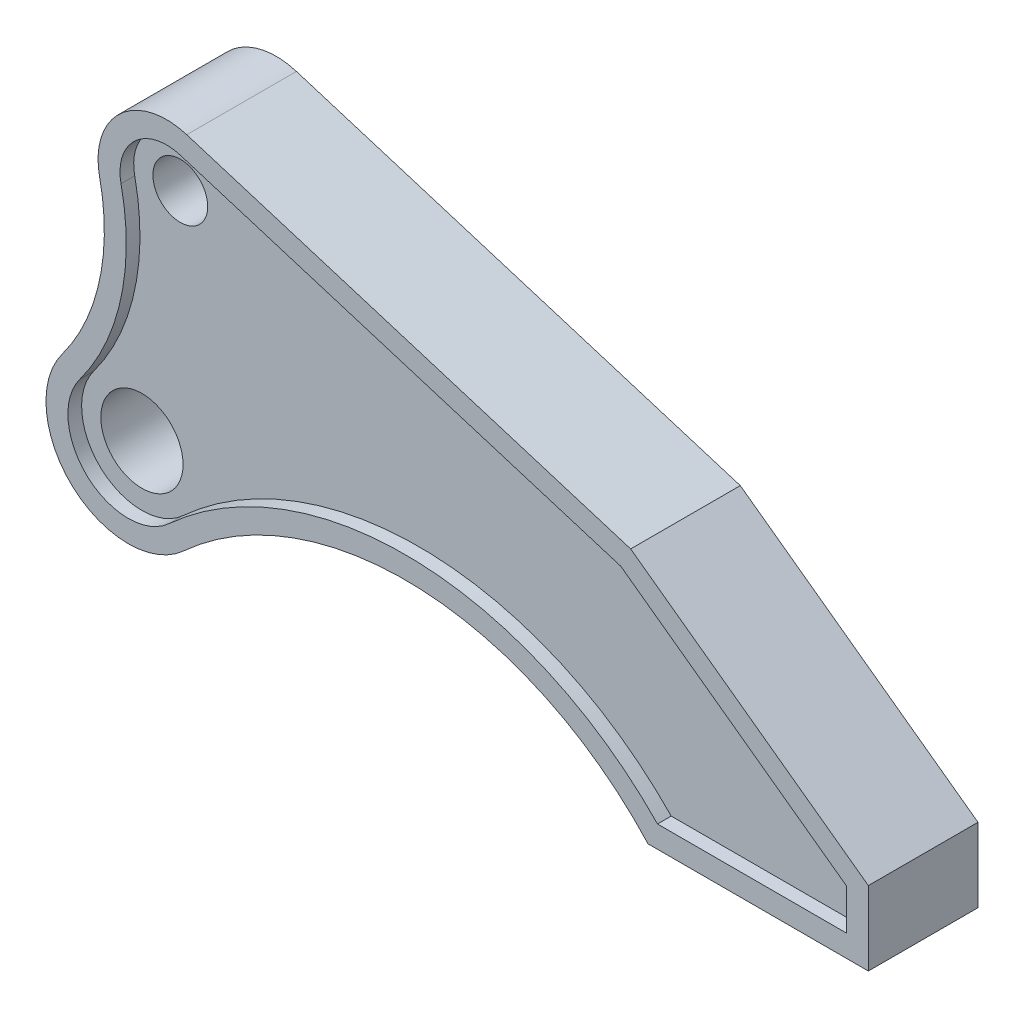
ISO-10303-21;
HEADER;
FILE_DESCRIPTION(('STEP AP214'),'2;1');
FILE_NAME('part.step','',(''),(''),'','','');
FILE_SCHEMA(('AUTOMOTIVE_DESIGN { 1 0 10303 214 1 1 1 1 }'));
ENDSEC;
DATA;
#1=APPLICATION_CONTEXT('core data for automotive mechanical design processes');
#2=APPLICATION_PROTOCOL_DEFINITION('international standard','automotive_design',2000,#1);
#3=PRODUCT_CONTEXT('',#1,'mechanical');
#4=PRODUCT('Part','Part','',(#3));
#5=PRODUCT_RELATED_PRODUCT_CATEGORY('part','',(#4));
#6=PRODUCT_DEFINITION_FORMATION('','',#4);
#7=PRODUCT_DEFINITION_CONTEXT('part definition',#1,'design');
#8=PRODUCT_DEFINITION('design','',#6,#7);
#9=PRODUCT_DEFINITION_SHAPE('','',#8);
#10=(LENGTH_UNIT() NAMED_UNIT(*) SI_UNIT(.MILLI.,.METRE.));
#11=(NAMED_UNIT(*) PLANE_ANGLE_UNIT() SI_UNIT($,.RADIAN.));
#12=(NAMED_UNIT(*) SI_UNIT($,.STERADIAN.) SOLID_ANGLE_UNIT());
#13=UNCERTAINTY_MEASURE_WITH_UNIT(LENGTH_MEASURE(1.E-05),#10,'distance_accuracy_value','');
#14=(GEOMETRIC_REPRESENTATION_CONTEXT(3) GLOBAL_UNCERTAINTY_ASSIGNED_CONTEXT((#13)) GLOBAL_UNIT_ASSIGNED_CONTEXT((#10,
#11,#12)) REPRESENTATION_CONTEXT('',''));
#15=CARTESIAN_POINT('',(0.,0.,0.));
#16=DIRECTION('',(0.,0.,1.));
#17=DIRECTION('',(1.,0.,0.));
#18=AXIS2_PLACEMENT_3D('',#15,#16,#17);
#19=CARTESIAN_POINT('',(0.,0.,15.));
#20=DIRECTION('',(0.,0.,1.));
#21=DIRECTION('',(1.,0.,0.));
#22=AXIS2_PLACEMENT_3D('',#19,#20,#21);
#23=PLANE('',#22);
#24=CARTESIAN_POINT('',(14.,86.,15.));
#25=DIRECTION('',(0.,0.,1.));
#26=DIRECTION('',(1.,0.,0.));
#27=AXIS2_PLACEMENT_3D('',#24,#25,#26);
#28=CIRCLE('',#27,10.);
#29=CARTESIAN_POINT('',(24.,86.,15.));
#30=VERTEX_POINT('',#29);
#31=EDGE_CURVE('E386',#30,#30,#28,.T.);
#32=ORIENTED_EDGE('',*,*,#31,.F.);
#33=EDGE_LOOP('',(#32));
#34=FACE_BOUND('',#33,.T.);
#35=CARTESIAN_POINT('',(0.,0.,15.));
#36=DIRECTION('',(0.,0.,1.));
#37=DIRECTION('',(1.,0.,0.));
#38=AXIS2_PLACEMENT_3D('',#35,#36,#37);
#39=CIRCLE('',#38,15.);
#40=CARTESIAN_POINT('',(15.,0.,15.));
#41=VERTEX_POINT('',#40);
#42=EDGE_CURVE('E391',#41,#41,#39,.T.);
#43=ORIENTED_EDGE('',*,*,#42,.F.);
#44=EDGE_LOOP('',(#43));
#45=FACE_BOUND('',#44,.T.);
#46=CARTESIAN_POINT('',(0.,0.,15.));
#47=DIRECTION('',(0.,0.,1.));
#48=DIRECTION('',(1.,0.,0.));
#49=AXIS2_PLACEMENT_3D('',#46,#47,#48);
#50=CIRCLE('',#49,22.);
#51=CARTESIAN_POINT('',(14.8133333333334,-16.2654589715617,15.));
#52=VERTEX_POINT('',#51);
#53=CARTESIAN_POINT('',(-17.6625754821289,13.1161513920089,15.));
#54=VERTEX_POINT('',#53);
#55=EDGE_CURVE('E52',#52,#54,#50,.F.);
#56=ORIENTED_EDGE('',*,*,#55,.F.);
#57=CARTESIAN_POINT('',(101.,-110.900856624284,15.));
#58=DIRECTION('',(0.,0.,1.));
#59=DIRECTION('',(1.,0.,0.));
#60=AXIS2_PLACEMENT_3D('',#57,#58,#59);
#61=CIRCLE('',#60,128.);
#62=CARTESIAN_POINT('',(193.090377844097,-22.,15.));
#63=VERTEX_POINT('',#62);
#64=EDGE_CURVE('E56',#63,#52,#61,.T.);
#65=ORIENTED_EDGE('',*,*,#64,.F.);
#66=DIRECTION('',(-1.,0.,0.));
#67=VECTOR('',#66,1.);
#68=CARTESIAN_POINT('',(0.,-22.,15.));
#69=LINE('',#68,#67);
#70=CARTESIAN_POINT('',(262.,-22.,15.));
#71=VERTEX_POINT('',#70);
#72=EDGE_CURVE('E345',#71,#63,#69,.T.);
#73=ORIENTED_EDGE('',*,*,#72,.F.);
#74=DIRECTION('',(0.,-1.,0.));
#75=VECTOR('',#74,1.);
#76=CARTESIAN_POINT('',(262.,0.,15.));
#77=LINE('',#76,#75);
#78=CARTESIAN_POINT('',(262.,-7.0762035959553,15.));
#79=VERTEX_POINT('',#78);
#80=EDGE_CURVE('E342',#79,#71,#77,.T.);
#81=ORIENTED_EDGE('',*,*,#80,.F.);
#82=DIRECTION('',(0.809016994374951,-0.587785252292468,0.));
#83=VECTOR('',#82,1.);
#84=CARTESIAN_POINT('',(87.1538389665981,119.956968253283,15.));
#85=LINE('',#84,#83);
#86=CARTESIAN_POINT('',(179.661480344658,52.7462326266555,15.));
#87=VERTEX_POINT('',#86);
#88=EDGE_CURVE('E339',#87,#79,#85,.T.);
#89=ORIENTED_EDGE('',*,*,#88,.F.);
#90=DIRECTION('',(0.955666007973527,-0.294452850561754,0.));
#91=VECTOR('',#90,1.);
#92=CARTESIAN_POINT('',(30.4198110964239,98.7294888752698,15.));
#93=LINE('',#92,#91);
#94=CARTESIAN_POINT('',(19.0056984595498,102.24632213555,15.));
#95=VERTEX_POINT('',#94);
#96=EDGE_CURVE('E336',#95,#87,#93,.T.);
#97=ORIENTED_EDGE('',*,*,#96,.F.);
#98=CARTESIAN_POINT('',(14.,86.,15.));
#99=DIRECTION('',(0.,0.,1.));
#100=DIRECTION('',(1.,0.,0.));
#101=AXIS2_PLACEMENT_3D('',#98,#99,#100);
#102=CIRCLE('',#101,17.);
#103=CARTESIAN_POINT('',(-2.6215748390065,82.4330335197389,15.));
#104=VERTEX_POINT('',#103);
#105=EDGE_CURVE('E333',#104,#95,#102,.F.);
#106=ORIENTED_EDGE('',*,*,#105,.F.);
#107=CARTESIAN_POINT('',(-86.7071887304512,64.3883795607711,15.));
#108=DIRECTION('',(0.,0.,1.));
#109=DIRECTION('',(1.,0.,0.));
#110=AXIS2_PLACEMENT_3D('',#107,#108,#109);
#111=CIRCLE('',#110,86.);
#112=EDGE_CURVE('E308',#54,#104,#111,.T.);
#113=ORIENTED_EDGE('',*,*,#112,.F.);
#114=EDGE_LOOP('',(#56,#65,#73,#81,#89,#97,#106,#113));
#115=FACE_BOUND('',#114,.T.);
#116=ADVANCED_FACE('F35',(#34,#45,#115),#23,.T.);
#117=CARTESIAN_POINT('',(0.,0.,20.));
#118=DIRECTION('',(0.,0.,1.));
#119=DIRECTION('',(1.,0.,0.));
#120=AXIS2_PLACEMENT_3D('',#117,#118,#119);
#121=PLANE('',#120);
#122=CARTESIAN_POINT('',(0.,0.,20.));
#123=DIRECTION('',(0.,0.,1.));
#124=DIRECTION('',(1.,0.,0.));
#125=AXIS2_PLACEMENT_3D('',#122,#123,#124);
#126=CIRCLE('',#125,30.);
#127=CARTESIAN_POINT('',(-24.0853302029031,17.8856609891031,20.));
#128=VERTEX_POINT('',#127);
#129=CARTESIAN_POINT('',(20.2,-22.1801713248568,20.));
#130=VERTEX_POINT('',#129);
#131=EDGE_CURVE('E283',#128,#130,#126,.T.);
#132=ORIENTED_EDGE('',*,*,#131,.T.);
#133=CARTESIAN_POINT('',(101.,-110.900856624284,20.));
#134=DIRECTION('',(0.,0.,-1.));
#135=DIRECTION('',(1.,0.,0.));
#136=AXIS2_PLACEMENT_3D('',#133,#134,#135);
#137=CIRCLE('',#136,120.);
#138=CARTESIAN_POINT('',(189.628727833909,-30.,20.));
#139=VERTEX_POINT('',#138);
#140=EDGE_CURVE('E286',#130,#139,#137,.T.);
#141=ORIENTED_EDGE('',*,*,#140,.T.);
#142=DIRECTION('',(1.,0.,0.));
#143=VECTOR('',#142,1.);
#144=CARTESIAN_POINT('',(189.628727833909,-30.,20.));
#145=LINE('',#144,#143);
#146=CARTESIAN_POINT('',(270.,-30.,20.));
#147=VERTEX_POINT('',#146);
#148=EDGE_CURVE('E290',#139,#147,#145,.T.);
#149=ORIENTED_EDGE('',*,*,#148,.T.);
#150=DIRECTION('',(0.,1.,0.));
#151=VECTOR('',#150,1.);
#152=CARTESIAN_POINT('',(270.,-30.,20.));
#153=LINE('',#152,#151);
#154=CARTESIAN_POINT('',(270.,-2.99999999999995,20.));
#155=VERTEX_POINT('',#154);
#156=EDGE_CURVE('E293',#147,#155,#153,.T.);
#157=ORIENTED_EDGE('',*,*,#156,.T.);
#158=DIRECTION('',(-0.809016994374951,0.587785252292468,0.));
#159=VECTOR('',#158,1.);
#160=CARTESIAN_POINT('',(270.,-2.99999999999995,20.));
#161=LINE('',#160,#159);
#162=CARTESIAN_POINT('',(183.287939010315,60.,20.));
#163=VERTEX_POINT('',#162);
#164=EDGE_CURVE('E296',#155,#163,#161,.T.);
#165=ORIENTED_EDGE('',*,*,#164,.T.);
#166=DIRECTION('',(-0.955666007973527,0.294452850561754,0.));
#167=VECTOR('',#166,1.);
#168=CARTESIAN_POINT('',(183.287939010315,60.,20.));
#169=LINE('',#168,#167);
#170=CARTESIAN_POINT('',(21.3613212640438,109.891650199338,20.));
#171=VERTEX_POINT('',#170);
#172=EDGE_CURVE('E299',#163,#171,#169,.T.);
#173=ORIENTED_EDGE('',*,*,#172,.T.);
#174=CARTESIAN_POINT('',(14.,86.,20.));
#175=DIRECTION('',(0.,0.,1.));
#176=DIRECTION('',(1.,0.,0.));
#177=AXIS2_PLACEMENT_3D('',#174,#175,#176);
#178=CIRCLE('',#177,25.);
#179=CARTESIAN_POINT('',(-10.4434924103037,80.7544610584396,20.));
#180=VERTEX_POINT('',#179);
#181=EDGE_CURVE('E302',#171,#180,#178,.T.);
#182=ORIENTED_EDGE('',*,*,#181,.T.);
#183=CARTESIAN_POINT('',(-86.7071887304512,64.3883795607711,20.));
#184=DIRECTION('',(0.,0.,-1.));
#185=DIRECTION('',(1.,0.,0.));
#186=AXIS2_PLACEMENT_3D('',#183,#184,#185);
#187=CIRCLE('',#186,78.);
#188=EDGE_CURVE('E305',#180,#128,#187,.T.);
#189=ORIENTED_EDGE('',*,*,#188,.T.);
#190=EDGE_LOOP('',(#132,#141,#149,#157,#165,#173,#182,#189));
#191=FACE_BOUND('',#190,.T.);
#192=CARTESIAN_POINT('',(101.,-110.900856624284,20.));
#193=DIRECTION('',(0.,0.,-1.));
#194=DIRECTION('',(1.,0.,0.));
#195=AXIS2_PLACEMENT_3D('',#192,#193,#194);
#196=CIRCLE('',#195,128.);
#197=CARTESIAN_POINT('',(14.8133333333334,-16.2654589715617,20.));
#198=VERTEX_POINT('',#197);
#199=CARTESIAN_POINT('',(193.090377844097,-22.,20.));
#200=VERTEX_POINT('',#199);
#201=EDGE_CURVE('E206',#198,#200,#196,.T.);
#202=ORIENTED_EDGE('',*,*,#201,.F.);
#203=CARTESIAN_POINT('',(0.,0.,20.));
#204=DIRECTION('',(0.,0.,1.));
#205=DIRECTION('',(1.,0.,0.));
#206=AXIS2_PLACEMENT_3D('',#203,#204,#205);
#207=CIRCLE('',#206,22.);
#208=CARTESIAN_POINT('',(-17.6625754821289,13.1161513920089,20.));
#209=VERTEX_POINT('',#208);
#210=EDGE_CURVE('E197',#209,#198,#207,.T.);
#211=ORIENTED_EDGE('',*,*,#210,.F.);
#212=CARTESIAN_POINT('',(-86.7071887304512,64.3883795607711,20.));
#213=DIRECTION('',(0.,0.,-1.));
#214=DIRECTION('',(1.,0.,0.));
#215=AXIS2_PLACEMENT_3D('',#212,#213,#214);
#216=CIRCLE('',#215,86.);
#217=CARTESIAN_POINT('',(-2.6215748390065,82.4330335197389,20.));
#218=VERTEX_POINT('',#217);
#219=EDGE_CURVE('E233',#218,#209,#216,.T.);
#220=ORIENTED_EDGE('',*,*,#219,.F.);
#221=CARTESIAN_POINT('',(14.,86.,20.));
#222=DIRECTION('',(0.,0.,1.));
#223=DIRECTION('',(1.,0.,0.));
#224=AXIS2_PLACEMENT_3D('',#221,#222,#223);
#225=CIRCLE('',#224,17.);
#226=CARTESIAN_POINT('',(19.0056984595498,102.24632213555,20.));
#227=VERTEX_POINT('',#226);
#228=EDGE_CURVE('E230',#227,#218,#225,.T.);
#229=ORIENTED_EDGE('',*,*,#228,.F.);
#230=DIRECTION('',(-0.955666007973527,0.294452850561754,0.));
#231=VECTOR('',#230,1.);
#232=CARTESIAN_POINT('',(179.661480344658,52.7462326266555,20.));
#233=LINE('',#232,#231);
#234=CARTESIAN_POINT('',(179.661480344658,52.7462326266555,20.));
#235=VERTEX_POINT('',#234);
#236=EDGE_CURVE('E228',#235,#227,#233,.T.);
#237=ORIENTED_EDGE('',*,*,#236,.F.);
#238=DIRECTION('',(-0.809016994374951,0.587785252292468,0.));
#239=VECTOR('',#238,1.);
#240=CARTESIAN_POINT('',(262.,-7.07620359595538,20.));
#241=LINE('',#240,#239);
#242=CARTESIAN_POINT('',(262.,-7.07620359595538,20.));
#243=VERTEX_POINT('',#242);
#244=EDGE_CURVE('E226',#243,#235,#241,.T.);
#245=ORIENTED_EDGE('',*,*,#244,.F.);
#246=DIRECTION('',(0.,1.,0.));
#247=VECTOR('',#246,1.);
#248=CARTESIAN_POINT('',(262.,-22.,20.));
#249=LINE('',#248,#247);
#250=CARTESIAN_POINT('',(262.,-22.,20.));
#251=VERTEX_POINT('',#250);
#252=EDGE_CURVE('E221',#251,#243,#249,.T.);
#253=ORIENTED_EDGE('',*,*,#252,.F.);
#254=DIRECTION('',(1.,0.,0.));
#255=VECTOR('',#254,1.);
#256=CARTESIAN_POINT('',(193.090377844097,-22.,20.));
#257=LINE('',#256,#255);
#258=EDGE_CURVE('E219',#200,#251,#257,.T.);
#259=ORIENTED_EDGE('',*,*,#258,.F.);
#260=EDGE_LOOP('',(#202,#211,#220,#229,#237,#245,#253,#259));
#261=FACE_BOUND('',#260,.T.);
#262=ADVANCED_FACE('F217',(#191,#261),#121,.T.);
#263=CARTESIAN_POINT('',(0.,0.,20.));
#264=DIRECTION('',(0.,0.,-1.));
#265=DIRECTION('',(-1.,0.,0.));
#266=AXIS2_PLACEMENT_3D('',#263,#264,#265);
#267=CYLINDRICAL_SURFACE('',#266,22.);
#268=DIRECTION('',(0.,0.,-1.));
#269=VECTOR('',#268,1.);
#270=CARTESIAN_POINT('',(14.8133333333334,-16.2654589715617,20.));
#271=LINE('',#270,#269);
#272=EDGE_CURVE('E200',#198,#52,#271,.T.);
#273=ORIENTED_EDGE('',*,*,#272,.T.);
#274=ORIENTED_EDGE('',*,*,#55,.T.);
#275=DIRECTION('',(0.,0.,-1.));
#276=VECTOR('',#275,1.);
#277=CARTESIAN_POINT('',(-17.6625754821289,13.1161513920089,20.));
#278=LINE('',#277,#276);
#279=EDGE_CURVE('E202',#209,#54,#278,.T.);
#280=ORIENTED_EDGE('',*,*,#279,.F.);
#281=ORIENTED_EDGE('',*,*,#210,.T.);
#282=EDGE_LOOP('',(#273,#274,#280,#281));
#283=FACE_BOUND('',#282,.T.);
#284=ADVANCED_FACE('F199',(#283),#267,.F.);
#285=CARTESIAN_POINT('',(101.,-110.900856624284,20.));
#286=DIRECTION('',(0.,0.,-1.));
#287=DIRECTION('',(-1.,0.,0.));
#288=AXIS2_PLACEMENT_3D('',#285,#286,#287);
#289=CYLINDRICAL_SURFACE('',#288,128.);
#290=DIRECTION('',(0.,0.,-1.));
#291=VECTOR('',#290,1.);
#292=CARTESIAN_POINT('',(193.090377844097,-22.,20.));
#293=LINE('',#292,#291);
#294=EDGE_CURVE('E281',#200,#63,#293,.T.);
#295=ORIENTED_EDGE('',*,*,#294,.T.);
#296=ORIENTED_EDGE('',*,*,#64,.T.);
#297=ORIENTED_EDGE('',*,*,#272,.F.);
#298=ORIENTED_EDGE('',*,*,#201,.T.);
#299=EDGE_LOOP('',(#295,#296,#297,#298));
#300=FACE_BOUND('',#299,.T.);
#301=ADVANCED_FACE('F211',(#300),#289,.T.);
#302=CARTESIAN_POINT('',(193.090377844097,-22.,20.));
#303=DIRECTION('',(0.,1.,0.));
#304=DIRECTION('',(-1.,0.,0.));
#305=AXIS2_PLACEMENT_3D('',#302,#303,#304);
#306=PLANE('',#305);
#307=DIRECTION('',(0.,0.,-1.));
#308=VECTOR('',#307,1.);
#309=CARTESIAN_POINT('',(262.,-22.,20.));
#310=LINE('',#309,#308);
#311=EDGE_CURVE('E277',#251,#71,#310,.T.);
#312=ORIENTED_EDGE('',*,*,#311,.T.);
#313=ORIENTED_EDGE('',*,*,#72,.T.);
#314=ORIENTED_EDGE('',*,*,#294,.F.);
#315=ORIENTED_EDGE('',*,*,#258,.T.);
#316=EDGE_LOOP('',(#312,#313,#314,#315));
#317=FACE_BOUND('',#316,.T.);
#318=ADVANCED_FACE('F527',(#317),#306,.T.);
#319=CARTESIAN_POINT('',(262.,-22.,20.));
#320=DIRECTION('',(-1.,0.,0.));
#321=DIRECTION('',(0.,0.,1.));
#322=AXIS2_PLACEMENT_3D('',#319,#320,#321);
#323=PLANE('',#322);
#324=DIRECTION('',(0.,0.,-1.));
#325=VECTOR('',#324,1.);
#326=CARTESIAN_POINT('',(262.,-7.07620359595538,20.));
#327=LINE('',#326,#325);
#328=EDGE_CURVE('E273',#243,#79,#327,.T.);
#329=ORIENTED_EDGE('',*,*,#328,.T.);
#330=ORIENTED_EDGE('',*,*,#80,.T.);
#331=ORIENTED_EDGE('',*,*,#311,.F.);
#332=ORIENTED_EDGE('',*,*,#252,.T.);
#333=EDGE_LOOP('',(#329,#330,#331,#332));
#334=FACE_BOUND('',#333,.T.);
#335=ADVANCED_FACE('F525',(#334),#323,.T.);
#336=CARTESIAN_POINT('',(262.,-7.07620359595538,20.));
#337=DIRECTION('',(-0.587785252292468,-0.809016994374951,0.));
#338=DIRECTION('',(0.809016994374951,-0.587785252292468,0.));
#339=AXIS2_PLACEMENT_3D('',#336,#337,#338);
#340=PLANE('',#339);
#341=DIRECTION('',(0.,0.,-1.));
#342=VECTOR('',#341,1.);
#343=CARTESIAN_POINT('',(179.661480344658,52.7462326266555,20.));
#344=LINE('',#343,#342);
#345=EDGE_CURVE('E269',#235,#87,#344,.T.);
#346=ORIENTED_EDGE('',*,*,#345,.T.);
#347=ORIENTED_EDGE('',*,*,#88,.T.);
#348=ORIENTED_EDGE('',*,*,#328,.F.);
#349=ORIENTED_EDGE('',*,*,#244,.T.);
#350=EDGE_LOOP('',(#346,#347,#348,#349));
#351=FACE_BOUND('',#350,.T.);
#352=ADVANCED_FACE('F521',(#351),#340,.T.);
#353=CARTESIAN_POINT('',(179.661480344658,52.7462326266555,20.));
#354=DIRECTION('',(-0.294452850561754,-0.955666007973527,0.));
#355=DIRECTION('',(0.955666007973527,-0.294452850561754,0.));
#356=AXIS2_PLACEMENT_3D('',#353,#354,#355);
#357=PLANE('',#356);
#358=DIRECTION('',(0.,0.,-1.));
#359=VECTOR('',#358,1.);
#360=CARTESIAN_POINT('',(19.0056984595498,102.24632213555,20.));
#361=LINE('',#360,#359);
#362=EDGE_CURVE('E265',#227,#95,#361,.T.);
#363=ORIENTED_EDGE('',*,*,#362,.T.);
#364=ORIENTED_EDGE('',*,*,#96,.T.);
#365=ORIENTED_EDGE('',*,*,#345,.F.);
#366=ORIENTED_EDGE('',*,*,#236,.T.);
#367=EDGE_LOOP('',(#363,#364,#365,#366));
#368=FACE_BOUND('',#367,.T.);
#369=ADVANCED_FACE('F512',(#368),#357,.T.);
#370=CARTESIAN_POINT('',(14.,86.,20.));
#371=DIRECTION('',(0.,0.,-1.));
#372=DIRECTION('',(-1.,0.,0.));
#373=AXIS2_PLACEMENT_3D('',#370,#371,#372);
#374=CYLINDRICAL_SURFACE('',#373,17.);
#375=DIRECTION('',(0.,0.,-1.));
#376=VECTOR('',#375,1.);
#377=CARTESIAN_POINT('',(-2.6215748390065,82.4330335197389,20.));
#378=LINE('',#377,#376);
#379=EDGE_CURVE('E261',#218,#104,#378,.T.);
#380=ORIENTED_EDGE('',*,*,#379,.T.);
#381=ORIENTED_EDGE('',*,*,#105,.T.);
#382=ORIENTED_EDGE('',*,*,#362,.F.);
#383=ORIENTED_EDGE('',*,*,#228,.T.);
#384=EDGE_LOOP('',(#380,#381,#382,#383));
#385=FACE_BOUND('',#384,.T.);
#386=ADVANCED_FACE('F504',(#385),#374,.F.);
#387=CARTESIAN_POINT('',(-86.7071887304512,64.3883795607711,20.));
#388=DIRECTION('',(0.,0.,-1.));
#389=DIRECTION('',(-1.,0.,0.));
#390=AXIS2_PLACEMENT_3D('',#387,#388,#389);
#391=CYLINDRICAL_SURFACE('',#390,86.);
#392=ORIENTED_EDGE('',*,*,#279,.T.);
#393=ORIENTED_EDGE('',*,*,#112,.T.);
#394=ORIENTED_EDGE('',*,*,#379,.F.);
#395=ORIENTED_EDGE('',*,*,#219,.T.);
#396=EDGE_LOOP('',(#392,#393,#394,#395));
#397=FACE_BOUND('',#396,.T.);
#398=ADVANCED_FACE('F499',(#397),#391,.T.);
#399=CARTESIAN_POINT('',(-86.7071887304512,64.3883795607711,15.));
#400=DIRECTION('',(0.,0.,-1.));
#401=DIRECTION('',(-1.,0.,0.));
#402=AXIS2_PLACEMENT_3D('',#399,#400,#401);
#403=CYLINDRICAL_SURFACE('',#402,78.);
#404=DIRECTION('',(0.,0.,-1.));
#405=VECTOR('',#404,1.);
#406=CARTESIAN_POINT('',(-10.4434924103037,80.7544610584396,15.));
#407=LINE('',#406,#405);
#408=CARTESIAN_POINT('',(-10.4434924103037,80.7544610584396,-20.));
#409=VERTEX_POINT('',#408);
#410=EDGE_CURVE('E349',#180,#409,#407,.T.);
#411=ORIENTED_EDGE('',*,*,#410,.T.);
#412=CARTESIAN_POINT('',(-86.7071887304512,64.3883795607711,-20.));
#413=DIRECTION('',(0.,0.,-1.));
#414=DIRECTION('',(1.,0.,0.));
#415=AXIS2_PLACEMENT_3D('',#412,#413,#414);
#416=CIRCLE('',#415,78.);
#417=CARTESIAN_POINT('',(-24.0853302029031,17.8856609891031,-20.));
#418=VERTEX_POINT('',#417);
#419=EDGE_CURVE('E287',#409,#418,#416,.T.);
#420=ORIENTED_EDGE('',*,*,#419,.T.);
#421=DIRECTION('',(0.,0.,-1.));
#422=VECTOR('',#421,1.);
#423=CARTESIAN_POINT('',(-24.0853302029031,17.8856609891031,15.));
#424=LINE('',#423,#422);
#425=EDGE_CURVE('E363',#128,#418,#424,.T.);
#426=ORIENTED_EDGE('',*,*,#425,.F.);
#427=ORIENTED_EDGE('',*,*,#188,.F.);
#428=EDGE_LOOP('',(#411,#420,#426,#427));
#429=FACE_BOUND('',#428,.T.);
#430=ADVANCED_FACE('F37',(#429),#403,.F.);
#431=CARTESIAN_POINT('',(14.,86.,15.));
#432=DIRECTION('',(0.,0.,-1.));
#433=DIRECTION('',(-1.,0.,0.));
#434=AXIS2_PLACEMENT_3D('',#431,#432,#433);
#435=CYLINDRICAL_SURFACE('',#434,25.);
#436=DIRECTION('',(0.,0.,-1.));
#437=VECTOR('',#436,1.);
#438=CARTESIAN_POINT('',(21.3613212640438,109.891650199338,15.));
#439=LINE('',#438,#437);
#440=CARTESIAN_POINT('',(21.3613212640438,109.891650199338,-20.));
#441=VERTEX_POINT('',#440);
#442=EDGE_CURVE('E351',#171,#441,#439,.T.);
#443=ORIENTED_EDGE('',*,*,#442,.T.);
#444=CARTESIAN_POINT('',(14.,86.,-20.));
#445=DIRECTION('',(0.,0.,1.));
#446=DIRECTION('',(1.,0.,0.));
#447=AXIS2_PLACEMENT_3D('',#444,#445,#446);
#448=CIRCLE('',#447,25.);
#449=EDGE_CURVE('E326',#441,#409,#448,.T.);
#450=ORIENTED_EDGE('',*,*,#449,.T.);
#451=ORIENTED_EDGE('',*,*,#410,.F.);
#452=ORIENTED_EDGE('',*,*,#181,.F.);
#453=EDGE_LOOP('',(#443,#450,#451,#452));
#454=FACE_BOUND('',#453,.T.);
#455=ADVANCED_FACE('F417',(#454),#435,.T.);
#456=CARTESIAN_POINT('',(32.7754339009179,106.374816939058,15.));
#457=DIRECTION('',(0.294452850561754,0.955666007973527,0.));
#458=DIRECTION('',(-0.955666007973527,0.294452850561754,0.));
#459=AXIS2_PLACEMENT_3D('',#456,#457,#458);
#460=PLANE('',#459);
#461=DIRECTION('',(0.,0.,-1.));
#462=VECTOR('',#461,1.);
#463=CARTESIAN_POINT('',(183.287939010315,60.,15.));
#464=LINE('',#463,#462);
#465=CARTESIAN_POINT('',(183.287939010315,60.,-20.));
#466=VERTEX_POINT('',#465);
#467=EDGE_CURVE('E353',#163,#466,#464,.T.);
#468=ORIENTED_EDGE('',*,*,#467,.T.);
#469=DIRECTION('',(-0.955666007973527,0.294452850561754,0.));
#470=VECTOR('',#469,1.);
#471=CARTESIAN_POINT('',(183.287939010315,60.,-20.));
#472=LINE('',#471,#470);
#473=EDGE_CURVE('E323',#466,#441,#472,.T.);
#474=ORIENTED_EDGE('',*,*,#473,.T.);
#475=ORIENTED_EDGE('',*,*,#442,.F.);
#476=ORIENTED_EDGE('',*,*,#172,.F.);
#477=EDGE_LOOP('',(#468,#474,#475,#476));
#478=FACE_BOUND('',#477,.T.);
#479=ADVANCED_FACE('F420',(#478),#460,.T.);
#480=CARTESIAN_POINT('',(91.8561209849378,126.429104208283,15.));
#481=DIRECTION('',(0.587785252292468,0.809016994374951,0.));
#482=DIRECTION('',(-0.809016994374951,0.587785252292468,0.));
#483=AXIS2_PLACEMENT_3D('',#480,#481,#482);
#484=PLANE('',#483);
#485=DIRECTION('',(0.,0.,-1.));
#486=VECTOR('',#485,1.);
#487=CARTESIAN_POINT('',(270.,-2.99999999999995,15.));
#488=LINE('',#487,#486);
#489=CARTESIAN_POINT('',(270.,-2.99999999999995,-20.));
#490=VERTEX_POINT('',#489);
#491=EDGE_CURVE('E355',#155,#490,#488,.T.);
#492=ORIENTED_EDGE('',*,*,#491,.T.);
#493=DIRECTION('',(-0.809016994374951,0.587785252292468,0.));
#494=VECTOR('',#493,1.);
#495=CARTESIAN_POINT('',(270.,-2.99999999999995,-20.));
#496=LINE('',#495,#494);
#497=EDGE_CURVE('E320',#490,#466,#496,.T.);
#498=ORIENTED_EDGE('',*,*,#497,.T.);
#499=ORIENTED_EDGE('',*,*,#467,.F.);
#500=ORIENTED_EDGE('',*,*,#164,.F.);
#501=EDGE_LOOP('',(#492,#498,#499,#500));
#502=FACE_BOUND('',#501,.T.);
#503=ADVANCED_FACE('F424',(#502),#484,.T.);
#504=CARTESIAN_POINT('',(270.,0.,15.));
#505=DIRECTION('',(1.,0.,0.));
#506=DIRECTION('',(0.,0.,-1.));
#507=AXIS2_PLACEMENT_3D('',#504,#505,#506);
#508=PLANE('',#507);
#509=DIRECTION('',(0.,0.,-1.));
#510=VECTOR('',#509,1.);
#511=CARTESIAN_POINT('',(270.,-30.,15.));
#512=LINE('',#511,#510);
#513=CARTESIAN_POINT('',(270.,-30.,-20.));
#514=VERTEX_POINT('',#513);
#515=EDGE_CURVE('E357',#147,#514,#512,.T.);
#516=ORIENTED_EDGE('',*,*,#515,.T.);
#517=DIRECTION('',(0.,1.,0.));
#518=VECTOR('',#517,1.);
#519=CARTESIAN_POINT('',(270.,-30.,-20.));
#520=LINE('',#519,#518);
#521=EDGE_CURVE('E317',#514,#490,#520,.T.);
#522=ORIENTED_EDGE('',*,*,#521,.T.);
#523=ORIENTED_EDGE('',*,*,#491,.F.);
#524=ORIENTED_EDGE('',*,*,#156,.F.);
#525=EDGE_LOOP('',(#516,#522,#523,#524));
#526=FACE_BOUND('',#525,.T.);
#527=ADVANCED_FACE('F428',(#526),#508,.T.);
#528=CARTESIAN_POINT('',(0.,-30.,15.));
#529=DIRECTION('',(0.,-1.,0.));
#530=DIRECTION('',(1.,0.,0.));
#531=AXIS2_PLACEMENT_3D('',#528,#529,#530);
#532=PLANE('',#531);
#533=DIRECTION('',(0.,0.,-1.));
#534=VECTOR('',#533,1.);
#535=CARTESIAN_POINT('',(189.628727833909,-30.,15.));
#536=LINE('',#535,#534);
#537=CARTESIAN_POINT('',(189.628727833909,-30.,-20.));
#538=VERTEX_POINT('',#537);
#539=EDGE_CURVE('E359',#139,#538,#536,.T.);
#540=ORIENTED_EDGE('',*,*,#539,.T.);
#541=DIRECTION('',(1.,0.,0.));
#542=VECTOR('',#541,1.);
#543=CARTESIAN_POINT('',(189.628727833909,-30.,-20.));
#544=LINE('',#543,#542);
#545=EDGE_CURVE('E314',#538,#514,#544,.T.);
#546=ORIENTED_EDGE('',*,*,#545,.T.);
#547=ORIENTED_EDGE('',*,*,#515,.F.);
#548=ORIENTED_EDGE('',*,*,#148,.F.);
#549=EDGE_LOOP('',(#540,#546,#547,#548));
#550=FACE_BOUND('',#549,.T.);
#551=ADVANCED_FACE('F432',(#550),#532,.T.);
#552=CARTESIAN_POINT('',(101.,-110.900856624284,15.));
#553=DIRECTION('',(0.,0.,-1.));
#554=DIRECTION('',(-1.,0.,0.));
#555=AXIS2_PLACEMENT_3D('',#552,#553,#554);
#556=CYLINDRICAL_SURFACE('',#555,120.);
#557=DIRECTION('',(0.,0.,-1.));
#558=VECTOR('',#557,1.);
#559=CARTESIAN_POINT('',(20.2,-22.1801713248568,15.));
#560=LINE('',#559,#558);
#561=CARTESIAN_POINT('',(20.2,-22.1801713248568,-20.));
#562=VERTEX_POINT('',#561);
#563=EDGE_CURVE('E361',#130,#562,#560,.T.);
#564=ORIENTED_EDGE('',*,*,#563,.T.);
#565=CARTESIAN_POINT('',(101.,-110.900856624284,-20.));
#566=DIRECTION('',(0.,0.,-1.));
#567=DIRECTION('',(1.,0.,0.));
#568=AXIS2_PLACEMENT_3D('',#565,#566,#567);
#569=CIRCLE('',#568,120.);
#570=EDGE_CURVE('E311',#562,#538,#569,.T.);
#571=ORIENTED_EDGE('',*,*,#570,.T.);
#572=ORIENTED_EDGE('',*,*,#539,.F.);
#573=ORIENTED_EDGE('',*,*,#140,.F.);
#574=EDGE_LOOP('',(#564,#571,#572,#573));
#575=FACE_BOUND('',#574,.T.);
#576=ADVANCED_FACE('F436',(#575),#556,.F.);
#577=CARTESIAN_POINT('',(0.,0.,15.));
#578=DIRECTION('',(0.,0.,-1.));
#579=DIRECTION('',(-1.,0.,0.));
#580=AXIS2_PLACEMENT_3D('',#577,#578,#579);
#581=CYLINDRICAL_SURFACE('',#580,30.);
#582=ORIENTED_EDGE('',*,*,#425,.T.);
#583=CARTESIAN_POINT('',(0.,0.,-20.));
#584=DIRECTION('',(0.,0.,1.));
#585=DIRECTION('',(1.,0.,0.));
#586=AXIS2_PLACEMENT_3D('',#583,#584,#585);
#587=CIRCLE('',#586,30.);
#588=EDGE_CURVE('E213',#418,#562,#587,.T.);
#589=ORIENTED_EDGE('',*,*,#588,.T.);
#590=ORIENTED_EDGE('',*,*,#563,.F.);
#591=ORIENTED_EDGE('',*,*,#131,.F.);
#592=EDGE_LOOP('',(#582,#589,#590,#591));
#593=FACE_BOUND('',#592,.T.);
#594=ADVANCED_FACE('F439',(#593),#581,.T.);
#595=CARTESIAN_POINT('',(0.,0.,-20.));
#596=DIRECTION('',(0.,0.,1.));
#597=DIRECTION('',(1.,0.,0.));
#598=AXIS2_PLACEMENT_3D('',#595,#596,#597);
#599=PLANE('',#598);
#600=ORIENTED_EDGE('',*,*,#588,.F.);
#601=ORIENTED_EDGE('',*,*,#419,.F.);
#602=ORIENTED_EDGE('',*,*,#449,.F.);
#603=ORIENTED_EDGE('',*,*,#473,.F.);
#604=ORIENTED_EDGE('',*,*,#497,.F.);
#605=ORIENTED_EDGE('',*,*,#521,.F.);
#606=ORIENTED_EDGE('',*,*,#545,.F.);
#607=ORIENTED_EDGE('',*,*,#570,.F.);
#608=EDGE_LOOP('',(#600,#601,#602,#603,#604,#605,#606,#607));
#609=FACE_BOUND('',#608,.T.);
#610=CARTESIAN_POINT('',(0.,0.,-20.));
#611=DIRECTION('',(0.,0.,1.));
#612=DIRECTION('',(1.,0.,0.));
#613=AXIS2_PLACEMENT_3D('',#610,#611,#612);
#614=CIRCLE('',#613,22.);
#615=CARTESIAN_POINT('',(-17.6625754821289,13.1161513920089,-20.));
#616=VERTEX_POINT('',#615);
#617=CARTESIAN_POINT('',(14.8133333333334,-16.2654589715617,-20.));
#618=VERTEX_POINT('',#617);
#619=EDGE_CURVE('E236',#616,#618,#614,.T.);
#620=ORIENTED_EDGE('',*,*,#619,.T.);
#621=CARTESIAN_POINT('',(101.,-110.900856624284,-20.));
#622=DIRECTION('',(0.,0.,-1.));
#623=DIRECTION('',(1.,0.,0.));
#624=AXIS2_PLACEMENT_3D('',#621,#622,#623);
#625=CIRCLE('',#624,128.);
#626=CARTESIAN_POINT('',(193.090377844097,-22.,-20.));
#627=VERTEX_POINT('',#626);
#628=EDGE_CURVE('E239',#618,#627,#625,.T.);
#629=ORIENTED_EDGE('',*,*,#628,.T.);
#630=DIRECTION('',(1.,0.,0.));
#631=VECTOR('',#630,1.);
#632=CARTESIAN_POINT('',(193.090377844097,-22.,-20.));
#633=LINE('',#632,#631);
#634=CARTESIAN_POINT('',(262.,-22.,-20.));
#635=VERTEX_POINT('',#634);
#636=EDGE_CURVE('E242',#627,#635,#633,.T.);
#637=ORIENTED_EDGE('',*,*,#636,.T.);
#638=DIRECTION('',(0.,1.,0.));
#639=VECTOR('',#638,1.);
#640=CARTESIAN_POINT('',(262.,-22.,-20.));
#641=LINE('',#640,#639);
#642=CARTESIAN_POINT('',(262.,-7.07620359595538,-20.));
#643=VERTEX_POINT('',#642);
#644=EDGE_CURVE('E245',#635,#643,#641,.T.);
#645=ORIENTED_EDGE('',*,*,#644,.T.);
#646=DIRECTION('',(-0.809016994374951,0.587785252292468,0.));
#647=VECTOR('',#646,1.);
#648=CARTESIAN_POINT('',(262.,-7.07620359595538,-20.));
#649=LINE('',#648,#647);
#650=CARTESIAN_POINT('',(179.661480344658,52.7462326266555,-20.));
#651=VERTEX_POINT('',#650);
#652=EDGE_CURVE('E248',#643,#651,#649,.T.);
#653=ORIENTED_EDGE('',*,*,#652,.T.);
#654=DIRECTION('',(-0.955666007973527,0.294452850561754,0.));
#655=VECTOR('',#654,1.);
#656=CARTESIAN_POINT('',(179.661480344658,52.7462326266555,-20.));
#657=LINE('',#656,#655);
#658=CARTESIAN_POINT('',(19.0056984595498,102.24632213555,-20.));
#659=VERTEX_POINT('',#658);
#660=EDGE_CURVE('E251',#651,#659,#657,.T.);
#661=ORIENTED_EDGE('',*,*,#660,.T.);
#662=CARTESIAN_POINT('',(14.,86.,-20.));
#663=DIRECTION('',(0.,0.,1.));
#664=DIRECTION('',(1.,0.,0.));
#665=AXIS2_PLACEMENT_3D('',#662,#663,#664);
#666=CIRCLE('',#665,17.);
#667=CARTESIAN_POINT('',(-2.6215748390065,82.4330335197389,-20.));
#668=VERTEX_POINT('',#667);
#669=EDGE_CURVE('E254',#659,#668,#666,.T.);
#670=ORIENTED_EDGE('',*,*,#669,.T.);
#671=CARTESIAN_POINT('',(-86.7071887304512,64.3883795607711,-20.));
#672=DIRECTION('',(0.,0.,-1.));
#673=DIRECTION('',(1.,0.,0.));
#674=AXIS2_PLACEMENT_3D('',#671,#672,#673);
#675=CIRCLE('',#674,86.);
#676=EDGE_CURVE('E207',#668,#616,#675,.T.);
#677=ORIENTED_EDGE('',*,*,#676,.T.);
#678=EDGE_LOOP('',(#620,#629,#637,#645,#653,#661,#670,#677));
#679=FACE_BOUND('',#678,.T.);
#680=ADVANCED_FACE('F411',(#609,#679),#599,.F.);
#681=CARTESIAN_POINT('',(-86.7071887304512,64.3883795607711,-15.));
#682=DIRECTION('',(0.,0.,1.));
#683=DIRECTION('',(1.,0.,0.));
#684=AXIS2_PLACEMENT_3D('',#681,#682,#683);
#685=CIRCLE('',#684,86.);
#686=CARTESIAN_POINT('',(-17.6625754821289,13.1161513920089,-15.));
#687=VERTEX_POINT('',#686);
#688=CARTESIAN_POINT('',(-2.6215748390065,82.4330335197389,-15.));
#689=VERTEX_POINT('',#688);
#690=EDGE_CURVE('E365',#687,#689,#685,.T.);
#691=ORIENTED_EDGE('',*,*,#690,.F.);
#692=EDGE_CURVE('E235',#687,#616,#278,.T.);
#693=ORIENTED_EDGE('',*,*,#692,.T.);
#694=ORIENTED_EDGE('',*,*,#676,.F.);
#695=EDGE_CURVE('E260',#689,#668,#378,.T.);
#696=ORIENTED_EDGE('',*,*,#695,.F.);
#697=EDGE_LOOP('',(#691,#693,#694,#696));
#698=FACE_BOUND('',#697,.T.);
#699=ADVANCED_FACE('F446',(#698),#391,.T.);
#700=CARTESIAN_POINT('',(14.,86.,-15.));
#701=DIRECTION('',(0.,0.,1.));
#702=DIRECTION('',(1.,0.,0.));
#703=AXIS2_PLACEMENT_3D('',#700,#701,#702);
#704=CIRCLE('',#703,17.);
#705=CARTESIAN_POINT('',(19.0056984595498,102.24632213555,-15.));
#706=VERTEX_POINT('',#705);
#707=EDGE_CURVE('E368',#689,#706,#704,.F.);
#708=ORIENTED_EDGE('',*,*,#707,.F.);
#709=ORIENTED_EDGE('',*,*,#695,.T.);
#710=ORIENTED_EDGE('',*,*,#669,.F.);
#711=EDGE_CURVE('E264',#706,#659,#361,.T.);
#712=ORIENTED_EDGE('',*,*,#711,.F.);
#713=EDGE_LOOP('',(#708,#709,#710,#712));
#714=FACE_BOUND('',#713,.T.);
#715=ADVANCED_FACE('F494',(#714),#374,.F.);
#716=DIRECTION('',(0.955666007973527,-0.294452850561754,0.));
#717=VECTOR('',#716,1.);
#718=CARTESIAN_POINT('',(30.4198110964239,98.7294888752698,-15.));
#719=LINE('',#718,#717);
#720=CARTESIAN_POINT('',(179.661480344658,52.7462326266555,-15.));
#721=VERTEX_POINT('',#720);
#722=EDGE_CURVE('E371',#706,#721,#719,.T.);
#723=ORIENTED_EDGE('',*,*,#722,.F.);
#724=ORIENTED_EDGE('',*,*,#711,.T.);
#725=ORIENTED_EDGE('',*,*,#660,.F.);
#726=EDGE_CURVE('E268',#721,#651,#344,.T.);
#727=ORIENTED_EDGE('',*,*,#726,.F.);
#728=EDGE_LOOP('',(#723,#724,#725,#727));
#729=FACE_BOUND('',#728,.T.);
#730=ADVANCED_FACE('F489',(#729),#357,.T.);
#731=DIRECTION('',(0.809016994374951,-0.587785252292468,0.));
#732=VECTOR('',#731,1.);
#733=CARTESIAN_POINT('',(87.1538389665981,119.956968253283,-15.));
#734=LINE('',#733,#732);
#735=CARTESIAN_POINT('',(262.,-7.07620359595538,-15.));
#736=VERTEX_POINT('',#735);
#737=EDGE_CURVE('E374',#721,#736,#734,.T.);
#738=ORIENTED_EDGE('',*,*,#737,.F.);
#739=ORIENTED_EDGE('',*,*,#726,.T.);
#740=ORIENTED_EDGE('',*,*,#652,.F.);
#741=EDGE_CURVE('E272',#736,#643,#327,.T.);
#742=ORIENTED_EDGE('',*,*,#741,.F.);
#743=EDGE_LOOP('',(#738,#739,#740,#742));
#744=FACE_BOUND('',#743,.T.);
#745=ADVANCED_FACE('F485',(#744),#340,.T.);
#746=DIRECTION('',(0.,-1.,0.));
#747=VECTOR('',#746,1.);
#748=CARTESIAN_POINT('',(262.,0.,-15.));
#749=LINE('',#748,#747);
#750=CARTESIAN_POINT('',(262.,-22.,-15.));
#751=VERTEX_POINT('',#750);
#752=EDGE_CURVE('E377',#736,#751,#749,.T.);
#753=ORIENTED_EDGE('',*,*,#752,.F.);
#754=ORIENTED_EDGE('',*,*,#741,.T.);
#755=ORIENTED_EDGE('',*,*,#644,.F.);
#756=EDGE_CURVE('E276',#751,#635,#310,.T.);
#757=ORIENTED_EDGE('',*,*,#756,.F.);
#758=EDGE_LOOP('',(#753,#754,#755,#757));
#759=FACE_BOUND('',#758,.T.);
#760=ADVANCED_FACE('F482',(#759),#323,.T.);
#761=DIRECTION('',(-1.,0.,0.));
#762=VECTOR('',#761,1.);
#763=CARTESIAN_POINT('',(0.,-22.,-15.));
#764=LINE('',#763,#762);
#765=CARTESIAN_POINT('',(193.090377844097,-22.,-15.));
#766=VERTEX_POINT('',#765);
#767=EDGE_CURVE('E380',#751,#766,#764,.T.);
#768=ORIENTED_EDGE('',*,*,#767,.F.);
#769=ORIENTED_EDGE('',*,*,#756,.T.);
#770=ORIENTED_EDGE('',*,*,#636,.F.);
#771=EDGE_CURVE('E280',#766,#627,#293,.T.);
#772=ORIENTED_EDGE('',*,*,#771,.F.);
#773=EDGE_LOOP('',(#768,#769,#770,#772));
#774=FACE_BOUND('',#773,.T.);
#775=ADVANCED_FACE('F477',(#774),#306,.T.);
#776=CARTESIAN_POINT('',(101.,-110.900856624284,-15.));
#777=DIRECTION('',(0.,0.,1.));
#778=DIRECTION('',(1.,0.,0.));
#779=AXIS2_PLACEMENT_3D('',#776,#777,#778);
#780=CIRCLE('',#779,128.);
#781=CARTESIAN_POINT('',(14.8133333333334,-16.2654589715617,-15.));
#782=VERTEX_POINT('',#781);
#783=EDGE_CURVE('E44',#766,#782,#780,.T.);
#784=ORIENTED_EDGE('',*,*,#783,.F.);
#785=ORIENTED_EDGE('',*,*,#771,.T.);
#786=ORIENTED_EDGE('',*,*,#628,.F.);
#787=EDGE_CURVE('E214',#782,#618,#271,.T.);
#788=ORIENTED_EDGE('',*,*,#787,.F.);
#789=EDGE_LOOP('',(#784,#785,#786,#788));
#790=FACE_BOUND('',#789,.T.);
#791=ADVANCED_FACE('F473',(#790),#289,.T.);
#792=CARTESIAN_POINT('',(0.,0.,-15.));
#793=DIRECTION('',(0.,0.,1.));
#794=DIRECTION('',(1.,0.,0.));
#795=AXIS2_PLACEMENT_3D('',#792,#793,#794);
#796=CIRCLE('',#795,22.);
#797=EDGE_CURVE('E11',#782,#687,#796,.F.);
#798=ORIENTED_EDGE('',*,*,#797,.F.);
#799=ORIENTED_EDGE('',*,*,#787,.T.);
#800=ORIENTED_EDGE('',*,*,#619,.F.);
#801=ORIENTED_EDGE('',*,*,#692,.F.);
#802=EDGE_LOOP('',(#798,#799,#800,#801));
#803=FACE_BOUND('',#802,.T.);
#804=ADVANCED_FACE('F415',(#803),#267,.F.);
#805=CARTESIAN_POINT('',(0.,0.,-15.));
#806=DIRECTION('',(0.,0.,1.));
#807=DIRECTION('',(1.,0.,0.));
#808=AXIS2_PLACEMENT_3D('',#805,#806,#807);
#809=PLANE('',#808);
#810=CARTESIAN_POINT('',(14.,86.,-15.));
#811=DIRECTION('',(0.,0.,1.));
#812=DIRECTION('',(1.,0.,0.));
#813=AXIS2_PLACEMENT_3D('',#810,#811,#812);
#814=CIRCLE('',#813,10.);
#815=CARTESIAN_POINT('',(24.,86.,-15.));
#816=VERTEX_POINT('',#815);
#817=EDGE_CURVE('E39',#816,#816,#814,.T.);
#818=ORIENTED_EDGE('',*,*,#817,.T.);
#819=EDGE_LOOP('',(#818));
#820=FACE_BOUND('',#819,.T.);
#821=CARTESIAN_POINT('',(0.,0.,-15.));
#822=DIRECTION('',(0.,0.,1.));
#823=DIRECTION('',(1.,0.,0.));
#824=AXIS2_PLACEMENT_3D('',#821,#822,#823);
#825=CIRCLE('',#824,15.);
#826=CARTESIAN_POINT('',(15.,0.,-15.));
#827=VERTEX_POINT('',#826);
#828=EDGE_CURVE('E384',#827,#827,#825,.T.);
#829=ORIENTED_EDGE('',*,*,#828,.T.);
#830=EDGE_LOOP('',(#829));
#831=FACE_BOUND('',#830,.T.);
#832=ORIENTED_EDGE('',*,*,#783,.T.);
#833=ORIENTED_EDGE('',*,*,#797,.T.);
#834=ORIENTED_EDGE('',*,*,#690,.T.);
#835=ORIENTED_EDGE('',*,*,#707,.T.);
#836=ORIENTED_EDGE('',*,*,#722,.T.);
#837=ORIENTED_EDGE('',*,*,#737,.T.);
#838=ORIENTED_EDGE('',*,*,#752,.T.);
#839=ORIENTED_EDGE('',*,*,#767,.T.);
#840=EDGE_LOOP('',(#832,#833,#834,#835,#836,#837,#838,#839));
#841=FACE_BOUND('',#840,.T.);
#842=ADVANCED_FACE('F412',(#820,#831,#841),#809,.F.);
#843=CARTESIAN_POINT('',(0.,0.,-25.));
#844=DIRECTION('',(0.,0.,1.));
#845=DIRECTION('',(1.,0.,0.));
#846=AXIS2_PLACEMENT_3D('',#843,#844,#845);
#847=CYLINDRICAL_SURFACE('',#846,15.);
#848=ORIENTED_EDGE('',*,*,#42,.T.);
#849=EDGE_LOOP('',(#848));
#850=FACE_BOUND('',#849,.T.);
#851=ORIENTED_EDGE('',*,*,#828,.F.);
#852=EDGE_LOOP('',(#851));
#853=FACE_BOUND('',#852,.T.);
#854=ADVANCED_FACE('F398',(#850,#853),#847,.F.);
#855=CARTESIAN_POINT('',(14.,86.,-25.));
#856=DIRECTION('',(0.,0.,1.));
#857=DIRECTION('',(1.,0.,0.));
#858=AXIS2_PLACEMENT_3D('',#855,#856,#857);
#859=CYLINDRICAL_SURFACE('',#858,10.);
#860=ORIENTED_EDGE('',*,*,#31,.T.);
#861=EDGE_LOOP('',(#860));
#862=FACE_BOUND('',#861,.T.);
#863=ORIENTED_EDGE('',*,*,#817,.F.);
#864=EDGE_LOOP('',(#863));
#865=FACE_BOUND('',#864,.T.);
#866=ADVANCED_FACE('F604',(#862,#865),#859,.F.);
#867=CLOSED_SHELL('',(#116,#262,#284,#301,#318,#335,#352,#369,#386,#398,#430,#455,#479,#503,
#527,#551,#576,#594,#680,#699,#715,#730,#745,#760,#775,#791,#804,#842,#854,#866));
#868=MANIFOLD_SOLID_BREP('B2',#867);
#869=ADVANCED_BREP_SHAPE_REPRESENTATION('',(#18,#868),#14);
#870=SHAPE_DEFINITION_REPRESENTATION(#9,#869);
ENDSEC;
END-ISO-10303-21;
